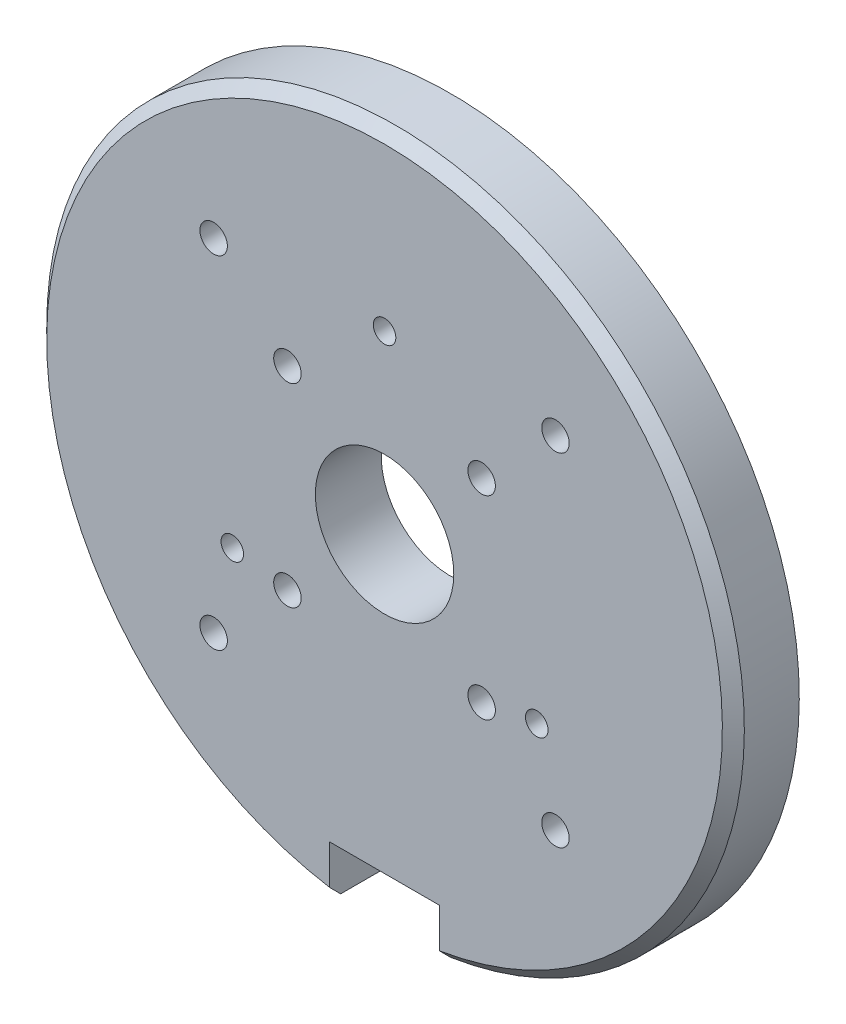
ISO-10303-21;
HEADER;
FILE_DESCRIPTION(('STEP AP214'),'2;1');
FILE_NAME('part.step','',(''),(''),'','','');
FILE_SCHEMA(('AUTOMOTIVE_DESIGN { 1 0 10303 214 1 1 1 1 }'));
ENDSEC;
DATA;
#1=APPLICATION_CONTEXT('core data for automotive mechanical design processes');
#2=APPLICATION_PROTOCOL_DEFINITION('international standard','automotive_design',2000,#1);
#3=PRODUCT_CONTEXT('',#1,'mechanical');
#4=PRODUCT('Part','Part','',(#3));
#5=PRODUCT_RELATED_PRODUCT_CATEGORY('part','',(#4));
#6=PRODUCT_DEFINITION_FORMATION('','',#4);
#7=PRODUCT_DEFINITION_CONTEXT('part definition',#1,'design');
#8=PRODUCT_DEFINITION('design','',#6,#7);
#9=PRODUCT_DEFINITION_SHAPE('','',#8);
#10=(LENGTH_UNIT() NAMED_UNIT(*) SI_UNIT(.MILLI.,.METRE.));
#11=(NAMED_UNIT(*) PLANE_ANGLE_UNIT() SI_UNIT($,.RADIAN.));
#12=(NAMED_UNIT(*) SI_UNIT($,.STERADIAN.) SOLID_ANGLE_UNIT());
#13=UNCERTAINTY_MEASURE_WITH_UNIT(LENGTH_MEASURE(1.E-05),#10,'distance_accuracy_value','');
#14=(GEOMETRIC_REPRESENTATION_CONTEXT(3) GLOBAL_UNCERTAINTY_ASSIGNED_CONTEXT((#13)) GLOBAL_UNIT_ASSIGNED_CONTEXT((#10,
#11,#12)) REPRESENTATION_CONTEXT('',''));
#15=CARTESIAN_POINT('',(0.,0.,0.));
#16=DIRECTION('',(0.,0.,1.));
#17=DIRECTION('',(1.,0.,0.));
#18=AXIS2_PLACEMENT_3D('',#15,#16,#17);
#19=CARTESIAN_POINT('',(0.,0.,6.));
#20=DIRECTION('',(0.,0.,-1.));
#21=DIRECTION('',(-1.,0.,0.));
#22=AXIS2_PLACEMENT_3D('',#19,#20,#21);
#23=CYLINDRICAL_SURFACE('',#22,31.75);
#24=DIRECTION('',(0.,0.,-1.));
#25=VECTOR('',#24,1.);
#26=CARTESIAN_POINT('',(-5.,-31.3538275175456,6.));
#27=LINE('',#26,#25);
#28=CARTESIAN_POINT('',(-5.,-31.3538275175456,0.));
#29=VERTEX_POINT('',#28);
#30=CARTESIAN_POINT('',(-5.,-31.3538275175456,5.00000000000001));
#31=VERTEX_POINT('',#30);
#32=EDGE_CURVE('E144',#29,#31,#27,.F.);
#33=ORIENTED_EDGE('',*,*,#32,.T.);
#34=CARTESIAN_POINT('',(0.,0.,5.00000000000001));
#35=DIRECTION('',(0.,0.,1.));
#36=DIRECTION('',(1.,0.,0.));
#37=AXIS2_PLACEMENT_3D('',#34,#35,#36);
#38=CIRCLE('',#37,31.75);
#39=CARTESIAN_POINT('',(5.,-31.3538275175456,5.));
#40=VERTEX_POINT('',#39);
#41=EDGE_CURVE('E50',#31,#40,#38,.F.);
#42=ORIENTED_EDGE('',*,*,#41,.T.);
#43=DIRECTION('',(0.,0.,-1.));
#44=VECTOR('',#43,1.);
#45=CARTESIAN_POINT('',(5.,-31.3538275175456,6.));
#46=LINE('',#45,#44);
#47=CARTESIAN_POINT('',(5.,-31.3538275175456,0.));
#48=VERTEX_POINT('',#47);
#49=EDGE_CURVE('E116',#40,#48,#46,.T.);
#50=ORIENTED_EDGE('',*,*,#49,.T.);
#51=CARTESIAN_POINT('',(0.,0.,0.));
#52=DIRECTION('',(0.,0.,1.));
#53=DIRECTION('',(1.,0.,0.));
#54=AXIS2_PLACEMENT_3D('',#51,#52,#53);
#55=CIRCLE('',#54,31.75);
#56=EDGE_CURVE('E111',#48,#29,#55,.T.);
#57=ORIENTED_EDGE('',*,*,#56,.T.);
#58=EDGE_LOOP('',(#33,#42,#50,#57));
#59=FACE_BOUND('',#58,.T.);
#60=ADVANCED_FACE('F37',(#59),#23,.T.);
#61=CARTESIAN_POINT('',(0.,0.,6.));
#62=DIRECTION('',(0.,0.,1.));
#63=DIRECTION('',(1.,0.,0.));
#64=AXIS2_PLACEMENT_3D('',#61,#62,#63);
#65=PLANE('',#64);
#66=CARTESIAN_POINT('',(0.,0.,6.));
#67=DIRECTION('',(0.,0.,1.));
#68=DIRECTION('',(1.,0.,0.));
#69=AXIS2_PLACEMENT_3D('',#66,#67,#68);
#70=CIRCLE('',#69,6.3);
#71=CARTESIAN_POINT('',(6.3,0.,6.));
#72=VERTEX_POINT('',#71);
#73=EDGE_CURVE('E225',#72,#72,#70,.T.);
#74=ORIENTED_EDGE('',*,*,#73,.F.);
#75=EDGE_LOOP('',(#74));
#76=FACE_BOUND('',#75,.T.);
#77=CARTESIAN_POINT('',(-15.5563491861041,15.556349186104,6.));
#78=DIRECTION('',(0.,0.,1.));
#79=DIRECTION('',(1.,0.,0.));
#80=AXIS2_PLACEMENT_3D('',#77,#78,#79);
#81=CIRCLE('',#80,1.24999999999999);
#82=CARTESIAN_POINT('',(-14.3063491861041,15.556349186104,6.));
#83=VERTEX_POINT('',#82);
#84=EDGE_CURVE('E221',#83,#83,#81,.T.);
#85=ORIENTED_EDGE('',*,*,#84,.F.);
#86=EDGE_LOOP('',(#85));
#87=FACE_BOUND('',#86,.T.);
#88=CARTESIAN_POINT('',(-15.556349186104,-15.5563491861041,6.));
#89=DIRECTION('',(0.,0.,1.));
#90=DIRECTION('',(1.,0.,0.));
#91=AXIS2_PLACEMENT_3D('',#88,#89,#90);
#92=CIRCLE('',#91,1.24999999999999);
#93=CARTESIAN_POINT('',(-14.306349186104,-15.5563491861041,6.));
#94=VERTEX_POINT('',#93);
#95=EDGE_CURVE('E215',#94,#94,#92,.T.);
#96=ORIENTED_EDGE('',*,*,#95,.F.);
#97=EDGE_LOOP('',(#96));
#98=FACE_BOUND('',#97,.T.);
#99=CARTESIAN_POINT('',(15.556349186104,-15.5563491861041,6.));
#100=DIRECTION('',(0.,0.,1.));
#101=DIRECTION('',(1.,0.,0.));
#102=AXIS2_PLACEMENT_3D('',#99,#100,#101);
#103=CIRCLE('',#102,1.24999999999999);
#104=CARTESIAN_POINT('',(16.806349186104,-15.5563491861041,6.));
#105=VERTEX_POINT('',#104);
#106=EDGE_CURVE('E209',#105,#105,#103,.T.);
#107=ORIENTED_EDGE('',*,*,#106,.F.);
#108=EDGE_LOOP('',(#107));
#109=FACE_BOUND('',#108,.T.);
#110=CARTESIAN_POINT('',(15.5563491861041,15.556349186104,6.));
#111=DIRECTION('',(0.,0.,1.));
#112=DIRECTION('',(1.,0.,0.));
#113=AXIS2_PLACEMENT_3D('',#110,#111,#112);
#114=CIRCLE('',#113,1.24999999999999);
#115=CARTESIAN_POINT('',(16.806349186104,15.556349186104,6.));
#116=VERTEX_POINT('',#115);
#117=EDGE_CURVE('E203',#116,#116,#114,.T.);
#118=ORIENTED_EDGE('',*,*,#117,.F.);
#119=EDGE_LOOP('',(#118));
#120=FACE_BOUND('',#119,.T.);
#121=CARTESIAN_POINT('',(8.83883476483186,8.83883476483183,6.));
#122=DIRECTION('',(0.,0.,1.));
#123=DIRECTION('',(1.,0.,0.));
#124=AXIS2_PLACEMENT_3D('',#121,#122,#123);
#125=CIRCLE('',#124,1.24999999999999);
#126=CARTESIAN_POINT('',(10.0888347648318,8.83883476483183,6.));
#127=VERTEX_POINT('',#126);
#128=EDGE_CURVE('E197',#127,#127,#125,.T.);
#129=ORIENTED_EDGE('',*,*,#128,.F.);
#130=EDGE_LOOP('',(#129));
#131=FACE_BOUND('',#130,.T.);
#132=CARTESIAN_POINT('',(-8.83883476483186,8.83883476483183,6.));
#133=DIRECTION('',(0.,0.,1.));
#134=DIRECTION('',(1.,0.,0.));
#135=AXIS2_PLACEMENT_3D('',#132,#133,#134);
#136=CIRCLE('',#135,1.24999999999999);
#137=CARTESIAN_POINT('',(-7.58883476483188,8.83883476483183,6.));
#138=VERTEX_POINT('',#137);
#139=EDGE_CURVE('E191',#138,#138,#136,.T.);
#140=ORIENTED_EDGE('',*,*,#139,.F.);
#141=EDGE_LOOP('',(#140));
#142=FACE_BOUND('',#141,.T.);
#143=CARTESIAN_POINT('',(-8.83883476483183,-8.83883476483186,6.));
#144=DIRECTION('',(0.,0.,1.));
#145=DIRECTION('',(1.,0.,0.));
#146=AXIS2_PLACEMENT_3D('',#143,#144,#145);
#147=CIRCLE('',#146,1.24999999999999);
#148=CARTESIAN_POINT('',(-7.58883476483184,-8.83883476483186,6.));
#149=VERTEX_POINT('',#148);
#150=EDGE_CURVE('E185',#149,#149,#147,.T.);
#151=ORIENTED_EDGE('',*,*,#150,.F.);
#152=EDGE_LOOP('',(#151));
#153=FACE_BOUND('',#152,.T.);
#154=CARTESIAN_POINT('',(8.83883476483183,-8.83883476483186,6.));
#155=DIRECTION('',(0.,0.,1.));
#156=DIRECTION('',(1.,0.,0.));
#157=AXIS2_PLACEMENT_3D('',#154,#155,#156);
#158=CIRCLE('',#157,1.24999999999999);
#159=CARTESIAN_POINT('',(10.0888347648318,-8.83883476483186,6.));
#160=VERTEX_POINT('',#159);
#161=EDGE_CURVE('E179',#160,#160,#158,.T.);
#162=ORIENTED_EDGE('',*,*,#161,.F.);
#163=EDGE_LOOP('',(#162));
#164=FACE_BOUND('',#163,.T.);
#165=CARTESIAN_POINT('',(0.,16.,6.));
#166=DIRECTION('',(0.,0.,1.));
#167=DIRECTION('',(1.,0.,0.));
#168=AXIS2_PLACEMENT_3D('',#165,#166,#167);
#169=CIRCLE('',#168,1.02499999999999);
#170=CARTESIAN_POINT('',(1.02499999999999,16.,6.));
#171=VERTEX_POINT('',#170);
#172=EDGE_CURVE('E173',#171,#171,#169,.T.);
#173=ORIENTED_EDGE('',*,*,#172,.F.);
#174=EDGE_LOOP('',(#173));
#175=FACE_BOUND('',#174,.T.);
#176=CARTESIAN_POINT('',(13.856406460551,-7.99999999999996,6.));
#177=DIRECTION('',(0.,0.,1.));
#178=DIRECTION('',(1.,0.,0.));
#179=AXIS2_PLACEMENT_3D('',#176,#177,#178);
#180=CIRCLE('',#179,1.02499999999999);
#181=CARTESIAN_POINT('',(14.881406460551,-7.99999999999996,6.));
#182=VERTEX_POINT('',#181);
#183=EDGE_CURVE('E167',#182,#182,#180,.T.);
#184=ORIENTED_EDGE('',*,*,#183,.F.);
#185=EDGE_LOOP('',(#184));
#186=FACE_BOUND('',#185,.T.);
#187=CARTESIAN_POINT('',(-13.856406460551,-7.99999999999997,6.));
#188=DIRECTION('',(0.,0.,1.));
#189=DIRECTION('',(1.,0.,0.));
#190=AXIS2_PLACEMENT_3D('',#187,#188,#189);
#191=CIRCLE('',#190,1.02499999999999);
#192=CARTESIAN_POINT('',(-12.831406460551,-7.99999999999997,6.));
#193=VERTEX_POINT('',#192);
#194=EDGE_CURVE('E156',#193,#193,#191,.T.);
#195=ORIENTED_EDGE('',*,*,#194,.F.);
#196=EDGE_LOOP('',(#195));
#197=FACE_BOUND('',#196,.T.);
#198=DIRECTION('',(0.,1.,0.));
#199=VECTOR('',#198,1.);
#200=CARTESIAN_POINT('',(5.,-26.75,6.));
#201=LINE('',#200,#199);
#202=CARTESIAN_POINT('',(5.,-30.3407728972088,6.));
#203=VERTEX_POINT('',#202);
#204=CARTESIAN_POINT('',(5.,-26.75,6.));
#205=VERTEX_POINT('',#204);
#206=EDGE_CURVE('E94',#203,#205,#201,.T.);
#207=ORIENTED_EDGE('',*,*,#206,.F.);
#208=CARTESIAN_POINT('',(0.,0.,6.));
#209=DIRECTION('',(0.,0.,1.));
#210=DIRECTION('',(1.,0.,0.));
#211=AXIS2_PLACEMENT_3D('',#208,#209,#210);
#212=CIRCLE('',#211,30.75);
#213=CARTESIAN_POINT('',(-5.,-30.3407728972088,6.));
#214=VERTEX_POINT('',#213);
#215=EDGE_CURVE('E112',#203,#214,#212,.T.);
#216=ORIENTED_EDGE('',*,*,#215,.T.);
#217=DIRECTION('',(0.,-1.,0.));
#218=VECTOR('',#217,1.);
#219=CARTESIAN_POINT('',(-5.,-26.75,6.));
#220=LINE('',#219,#218);
#221=CARTESIAN_POINT('',(-5.,-26.75,6.));
#222=VERTEX_POINT('',#221);
#223=EDGE_CURVE('E107',#222,#214,#220,.T.);
#224=ORIENTED_EDGE('',*,*,#223,.F.);
#225=DIRECTION('',(-1.,0.,0.));
#226=VECTOR('',#225,1.);
#227=CARTESIAN_POINT('',(-5.,-26.75,6.));
#228=LINE('',#227,#226);
#229=EDGE_CURVE('E151',#205,#222,#228,.T.);
#230=ORIENTED_EDGE('',*,*,#229,.F.);
#231=EDGE_LOOP('',(#207,#216,#224,#230));
#232=FACE_BOUND('',#231,.T.);
#233=ADVANCED_FACE('F135',(#76,#87,#98,#109,#120,#131,#142,#153,#164,#175,#186,#197,#232),#65,.T.);
#234=CARTESIAN_POINT('',(0.,0.,0.));
#235=DIRECTION('',(0.,0.,1.));
#236=DIRECTION('',(1.,0.,0.));
#237=AXIS2_PLACEMENT_3D('',#234,#235,#236);
#238=PLANE('',#237);
#239=CARTESIAN_POINT('',(0.,0.,0.));
#240=DIRECTION('',(0.,0.,1.));
#241=DIRECTION('',(1.,0.,0.));
#242=AXIS2_PLACEMENT_3D('',#239,#240,#241);
#243=CIRCLE('',#242,6.3);
#244=CARTESIAN_POINT('',(6.3,0.,0.));
#245=VERTEX_POINT('',#244);
#246=EDGE_CURVE('E224',#245,#245,#243,.T.);
#247=ORIENTED_EDGE('',*,*,#246,.T.);
#248=EDGE_LOOP('',(#247));
#249=FACE_BOUND('',#248,.T.);
#250=CARTESIAN_POINT('',(-15.5563491861041,15.556349186104,0.));
#251=DIRECTION('',(0.,0.,1.));
#252=DIRECTION('',(1.,0.,0.));
#253=AXIS2_PLACEMENT_3D('',#250,#251,#252);
#254=CIRCLE('',#253,1.25);
#255=CARTESIAN_POINT('',(-14.3063491861041,15.556349186104,0.));
#256=VERTEX_POINT('',#255);
#257=EDGE_CURVE('E218',#256,#256,#254,.T.);
#258=ORIENTED_EDGE('',*,*,#257,.T.);
#259=EDGE_LOOP('',(#258));
#260=FACE_BOUND('',#259,.T.);
#261=CARTESIAN_POINT('',(-15.556349186104,-15.5563491861041,0.));
#262=DIRECTION('',(0.,0.,1.));
#263=DIRECTION('',(1.,0.,0.));
#264=AXIS2_PLACEMENT_3D('',#261,#262,#263);
#265=CIRCLE('',#264,1.25);
#266=CARTESIAN_POINT('',(-14.306349186104,-15.5563491861041,0.));
#267=VERTEX_POINT('',#266);
#268=EDGE_CURVE('E212',#267,#267,#265,.T.);
#269=ORIENTED_EDGE('',*,*,#268,.T.);
#270=EDGE_LOOP('',(#269));
#271=FACE_BOUND('',#270,.T.);
#272=CARTESIAN_POINT('',(15.556349186104,-15.5563491861041,0.));
#273=DIRECTION('',(0.,0.,1.));
#274=DIRECTION('',(1.,0.,0.));
#275=AXIS2_PLACEMENT_3D('',#272,#273,#274);
#276=CIRCLE('',#275,1.25);
#277=CARTESIAN_POINT('',(16.806349186104,-15.5563491861041,0.));
#278=VERTEX_POINT('',#277);
#279=EDGE_CURVE('E206',#278,#278,#276,.T.);
#280=ORIENTED_EDGE('',*,*,#279,.T.);
#281=EDGE_LOOP('',(#280));
#282=FACE_BOUND('',#281,.T.);
#283=CARTESIAN_POINT('',(15.5563491861041,15.556349186104,0.));
#284=DIRECTION('',(0.,0.,1.));
#285=DIRECTION('',(1.,0.,0.));
#286=AXIS2_PLACEMENT_3D('',#283,#284,#285);
#287=CIRCLE('',#286,1.25);
#288=CARTESIAN_POINT('',(16.8063491861041,15.556349186104,0.));
#289=VERTEX_POINT('',#288);
#290=EDGE_CURVE('E200',#289,#289,#287,.T.);
#291=ORIENTED_EDGE('',*,*,#290,.T.);
#292=EDGE_LOOP('',(#291));
#293=FACE_BOUND('',#292,.T.);
#294=CARTESIAN_POINT('',(8.83883476483186,8.83883476483183,0.));
#295=DIRECTION('',(0.,0.,1.));
#296=DIRECTION('',(1.,0.,0.));
#297=AXIS2_PLACEMENT_3D('',#294,#295,#296);
#298=CIRCLE('',#297,1.25);
#299=CARTESIAN_POINT('',(10.0888347648319,8.83883476483183,0.));
#300=VERTEX_POINT('',#299);
#301=EDGE_CURVE('E194',#300,#300,#298,.T.);
#302=ORIENTED_EDGE('',*,*,#301,.T.);
#303=EDGE_LOOP('',(#302));
#304=FACE_BOUND('',#303,.T.);
#305=CARTESIAN_POINT('',(-8.83883476483186,8.83883476483183,0.));
#306=DIRECTION('',(0.,0.,1.));
#307=DIRECTION('',(1.,0.,0.));
#308=AXIS2_PLACEMENT_3D('',#305,#306,#307);
#309=CIRCLE('',#308,1.25);
#310=CARTESIAN_POINT('',(-7.58883476483187,8.83883476483183,0.));
#311=VERTEX_POINT('',#310);
#312=EDGE_CURVE('E188',#311,#311,#309,.T.);
#313=ORIENTED_EDGE('',*,*,#312,.T.);
#314=EDGE_LOOP('',(#313));
#315=FACE_BOUND('',#314,.T.);
#316=CARTESIAN_POINT('',(-8.83883476483183,-8.83883476483186,0.));
#317=DIRECTION('',(0.,0.,1.));
#318=DIRECTION('',(1.,0.,0.));
#319=AXIS2_PLACEMENT_3D('',#316,#317,#318);
#320=CIRCLE('',#319,1.25);
#321=CARTESIAN_POINT('',(-7.58883476483183,-8.83883476483186,0.));
#322=VERTEX_POINT('',#321);
#323=EDGE_CURVE('E182',#322,#322,#320,.T.);
#324=ORIENTED_EDGE('',*,*,#323,.T.);
#325=EDGE_LOOP('',(#324));
#326=FACE_BOUND('',#325,.T.);
#327=CARTESIAN_POINT('',(8.83883476483183,-8.83883476483186,0.));
#328=DIRECTION('',(0.,0.,1.));
#329=DIRECTION('',(1.,0.,0.));
#330=AXIS2_PLACEMENT_3D('',#327,#328,#329);
#331=CIRCLE('',#330,1.25);
#332=CARTESIAN_POINT('',(10.0888347648318,-8.83883476483186,0.));
#333=VERTEX_POINT('',#332);
#334=EDGE_CURVE('E176',#333,#333,#331,.T.);
#335=ORIENTED_EDGE('',*,*,#334,.T.);
#336=EDGE_LOOP('',(#335));
#337=FACE_BOUND('',#336,.T.);
#338=CARTESIAN_POINT('',(0.,16.,0.));
#339=DIRECTION('',(0.,0.,1.));
#340=DIRECTION('',(1.,0.,0.));
#341=AXIS2_PLACEMENT_3D('',#338,#339,#340);
#342=CIRCLE('',#341,1.025);
#343=CARTESIAN_POINT('',(1.025,16.,0.));
#344=VERTEX_POINT('',#343);
#345=EDGE_CURVE('E170',#344,#344,#342,.T.);
#346=ORIENTED_EDGE('',*,*,#345,.T.);
#347=EDGE_LOOP('',(#346));
#348=FACE_BOUND('',#347,.T.);
#349=CARTESIAN_POINT('',(13.856406460551,-7.99999999999996,0.));
#350=DIRECTION('',(0.,0.,1.));
#351=DIRECTION('',(1.,0.,0.));
#352=AXIS2_PLACEMENT_3D('',#349,#350,#351);
#353=CIRCLE('',#352,1.025);
#354=CARTESIAN_POINT('',(14.881406460551,-7.99999999999996,0.));
#355=VERTEX_POINT('',#354);
#356=EDGE_CURVE('E164',#355,#355,#353,.T.);
#357=ORIENTED_EDGE('',*,*,#356,.T.);
#358=EDGE_LOOP('',(#357));
#359=FACE_BOUND('',#358,.T.);
#360=CARTESIAN_POINT('',(-13.856406460551,-7.99999999999997,0.));
#361=DIRECTION('',(0.,0.,1.));
#362=DIRECTION('',(1.,0.,0.));
#363=AXIS2_PLACEMENT_3D('',#360,#361,#362);
#364=CIRCLE('',#363,1.025);
#365=CARTESIAN_POINT('',(-12.831406460551,-7.99999999999997,0.));
#366=VERTEX_POINT('',#365);
#367=EDGE_CURVE('E152',#366,#366,#364,.T.);
#368=ORIENTED_EDGE('',*,*,#367,.T.);
#369=EDGE_LOOP('',(#368));
#370=FACE_BOUND('',#369,.T.);
#371=ORIENTED_EDGE('',*,*,#56,.F.);
#372=DIRECTION('',(0.,1.,0.));
#373=VECTOR('',#372,1.);
#374=CARTESIAN_POINT('',(4.99999999999999,0.,0.));
#375=LINE('',#374,#373);
#376=CARTESIAN_POINT('',(5.,-26.75,0.));
#377=VERTEX_POINT('',#376);
#378=EDGE_CURVE('E91',#48,#377,#375,.T.);
#379=ORIENTED_EDGE('',*,*,#378,.T.);
#380=DIRECTION('',(-1.,0.,0.));
#381=VECTOR('',#380,1.);
#382=CARTESIAN_POINT('',(-5.,-26.75,0.));
#383=LINE('',#382,#381);
#384=CARTESIAN_POINT('',(-5.,-26.75,0.));
#385=VERTEX_POINT('',#384);
#386=EDGE_CURVE('E103',#377,#385,#383,.T.);
#387=ORIENTED_EDGE('',*,*,#386,.T.);
#388=DIRECTION('',(0.,-1.,0.));
#389=VECTOR('',#388,1.);
#390=CARTESIAN_POINT('',(-5.,-26.75,0.));
#391=LINE('',#390,#389);
#392=EDGE_CURVE('E99',#385,#29,#391,.T.);
#393=ORIENTED_EDGE('',*,*,#392,.T.);
#394=EDGE_LOOP('',(#371,#379,#387,#393));
#395=FACE_BOUND('',#394,.T.);
#396=ADVANCED_FACE('F109',(#249,#260,#271,#282,#293,#304,#315,#326,#337,#348,#359,#370,#395),
#238,.F.);
#397=CARTESIAN_POINT('',(5.,-26.75,0.));
#398=DIRECTION('',(1.,0.,0.));
#399=DIRECTION('',(0.,1.,0.));
#400=AXIS2_PLACEMENT_3D('',#397,#398,#399);
#401=PLANE('',#400);
#402=ORIENTED_EDGE('',*,*,#49,.F.);
#403=CARTESIAN_POINT('',(5.,-31.3538275175456,5.00000000000001));
#404=CARTESIAN_POINT('',(5.,-31.1850201174581,5.16670216063221));
#405=CARTESIAN_POINT('',(5.,-31.0161951990678,5.33338657426692));
#406=CARTESIAN_POINT('',(5.,-30.6785103256222,5.66671990760026));
#407=CARTESIAN_POINT('',(5.,-30.5096503705669,5.83336882729889));
#408=CARTESIAN_POINT('',(5.,-30.3407728972088,6.));
#409=B_SPLINE_CURVE_WITH_KNOTS('',3,(#403,#404,#405,#406,#407,#408),.UNSPECIFIED.,.F.,.F.,(4,2,
4),(0.,0.711737255849346,1.42347451195032),.UNSPECIFIED.);
#410=EDGE_CURVE('E11',#40,#203,#409,.T.);
#411=ORIENTED_EDGE('',*,*,#410,.T.);
#412=ORIENTED_EDGE('',*,*,#206,.T.);
#413=DIRECTION('',(0.,0.,1.));
#414=VECTOR('',#413,1.);
#415=CARTESIAN_POINT('',(5.,-26.75,0.));
#416=LINE('',#415,#414);
#417=EDGE_CURVE('E87',#377,#205,#416,.T.);
#418=ORIENTED_EDGE('',*,*,#417,.F.);
#419=ORIENTED_EDGE('',*,*,#378,.F.);
#420=EDGE_LOOP('',(#402,#411,#412,#418,#419));
#421=FACE_BOUND('',#420,.T.);
#422=ADVANCED_FACE('F89',(#421),#401,.F.);
#423=CARTESIAN_POINT('',(-5.,-26.75,0.));
#424=DIRECTION('',(-1.,0.,0.));
#425=DIRECTION('',(0.,-1.,0.));
#426=AXIS2_PLACEMENT_3D('',#423,#424,#425);
#427=PLANE('',#426);
#428=ORIENTED_EDGE('',*,*,#223,.T.);
#429=CARTESIAN_POINT('',(-5.,-30.3407728972088,6.));
#430=CARTESIAN_POINT('',(-5.,-30.5096503705669,5.83336882729889));
#431=CARTESIAN_POINT('',(-5.,-30.6785103256222,5.66671990760027));
#432=CARTESIAN_POINT('',(-5.,-31.0161951990678,5.33338657426692));
#433=CARTESIAN_POINT('',(-5.,-31.1850201174581,5.16670216063222));
#434=CARTESIAN_POINT('',(-5.,-31.3538275175456,5.00000000000001));
#435=B_SPLINE_CURVE_WITH_KNOTS('',3,(#429,#430,#431,#432,#433,#434),.UNSPECIFIED.,.F.,.F.,(4,2,
4),(0.,0.71173725610097,1.42347451195031),.UNSPECIFIED.);
#436=EDGE_CURVE('E64',#214,#31,#435,.T.);
#437=ORIENTED_EDGE('',*,*,#436,.T.);
#438=ORIENTED_EDGE('',*,*,#32,.F.);
#439=ORIENTED_EDGE('',*,*,#392,.F.);
#440=DIRECTION('',(0.,0.,1.));
#441=VECTOR('',#440,1.);
#442=CARTESIAN_POINT('',(-5.,-26.75,0.));
#443=LINE('',#442,#441);
#444=EDGE_CURVE('E98',#385,#222,#443,.T.);
#445=ORIENTED_EDGE('',*,*,#444,.T.);
#446=EDGE_LOOP('',(#428,#437,#438,#439,#445));
#447=FACE_BOUND('',#446,.T.);
#448=ADVANCED_FACE('F124',(#447),#427,.F.);
#449=CARTESIAN_POINT('',(-5.,-26.75,0.));
#450=DIRECTION('',(0.,1.,0.));
#451=DIRECTION('',(0.,0.,1.));
#452=AXIS2_PLACEMENT_3D('',#449,#450,#451);
#453=PLANE('',#452);
#454=ORIENTED_EDGE('',*,*,#229,.T.);
#455=ORIENTED_EDGE('',*,*,#444,.F.);
#456=ORIENTED_EDGE('',*,*,#386,.F.);
#457=ORIENTED_EDGE('',*,*,#417,.T.);
#458=EDGE_LOOP('',(#454,#455,#456,#457));
#459=FACE_BOUND('',#458,.T.);
#460=ADVANCED_FACE('F104',(#459),#453,.F.);
#461=CARTESIAN_POINT('',(-13.856406460551,-7.99999999999997,6.));
#462=DIRECTION('',(0.,0.,1.));
#463=DIRECTION('',(1.,0.,0.));
#464=AXIS2_PLACEMENT_3D('',#461,#462,#463);
#465=CYLINDRICAL_SURFACE('',#464,1.02499999999999);
#466=ORIENTED_EDGE('',*,*,#367,.F.);
#467=EDGE_LOOP('',(#466));
#468=FACE_BOUND('',#467,.T.);
#469=ORIENTED_EDGE('',*,*,#194,.T.);
#470=EDGE_LOOP('',(#469));
#471=FACE_BOUND('',#470,.T.);
#472=ADVANCED_FACE('F129',(#468,#471),#465,.F.);
#473=CARTESIAN_POINT('',(13.856406460551,-7.99999999999996,6.));
#474=DIRECTION('',(0.,0.,1.));
#475=DIRECTION('',(1.,0.,0.));
#476=AXIS2_PLACEMENT_3D('',#473,#474,#475);
#477=CYLINDRICAL_SURFACE('',#476,1.02499999999999);
#478=ORIENTED_EDGE('',*,*,#356,.F.);
#479=EDGE_LOOP('',(#478));
#480=FACE_BOUND('',#479,.T.);
#481=ORIENTED_EDGE('',*,*,#183,.T.);
#482=EDGE_LOOP('',(#481));
#483=FACE_BOUND('',#482,.T.);
#484=ADVANCED_FACE('F262',(#480,#483),#477,.F.);
#485=CARTESIAN_POINT('',(0.,16.,6.));
#486=DIRECTION('',(0.,0.,1.));
#487=DIRECTION('',(1.,0.,0.));
#488=AXIS2_PLACEMENT_3D('',#485,#486,#487);
#489=CYLINDRICAL_SURFACE('',#488,1.02499999999999);
#490=ORIENTED_EDGE('',*,*,#345,.F.);
#491=EDGE_LOOP('',(#490));
#492=FACE_BOUND('',#491,.T.);
#493=ORIENTED_EDGE('',*,*,#172,.T.);
#494=EDGE_LOOP('',(#493));
#495=FACE_BOUND('',#494,.T.);
#496=ADVANCED_FACE('F267',(#492,#495),#489,.F.);
#497=CARTESIAN_POINT('',(8.83883476483183,-8.83883476483186,6.));
#498=DIRECTION('',(0.,0.,1.));
#499=DIRECTION('',(1.,0.,0.));
#500=AXIS2_PLACEMENT_3D('',#497,#498,#499);
#501=CYLINDRICAL_SURFACE('',#500,1.24999999999999);
#502=ORIENTED_EDGE('',*,*,#334,.F.);
#503=EDGE_LOOP('',(#502));
#504=FACE_BOUND('',#503,.T.);
#505=ORIENTED_EDGE('',*,*,#161,.T.);
#506=EDGE_LOOP('',(#505));
#507=FACE_BOUND('',#506,.T.);
#508=ADVANCED_FACE('F274',(#504,#507),#501,.F.);
#509=CARTESIAN_POINT('',(-8.83883476483183,-8.83883476483186,6.));
#510=DIRECTION('',(0.,0.,1.));
#511=DIRECTION('',(1.,0.,0.));
#512=AXIS2_PLACEMENT_3D('',#509,#510,#511);
#513=CYLINDRICAL_SURFACE('',#512,1.24999999999999);
#514=ORIENTED_EDGE('',*,*,#323,.F.);
#515=EDGE_LOOP('',(#514));
#516=FACE_BOUND('',#515,.T.);
#517=ORIENTED_EDGE('',*,*,#150,.T.);
#518=EDGE_LOOP('',(#517));
#519=FACE_BOUND('',#518,.T.);
#520=ADVANCED_FACE('F282',(#516,#519),#513,.F.);
#521=CARTESIAN_POINT('',(-8.83883476483186,8.83883476483183,6.));
#522=DIRECTION('',(0.,0.,1.));
#523=DIRECTION('',(1.,0.,0.));
#524=AXIS2_PLACEMENT_3D('',#521,#522,#523);
#525=CYLINDRICAL_SURFACE('',#524,1.24999999999999);
#526=ORIENTED_EDGE('',*,*,#312,.F.);
#527=EDGE_LOOP('',(#526));
#528=FACE_BOUND('',#527,.T.);
#529=ORIENTED_EDGE('',*,*,#139,.T.);
#530=EDGE_LOOP('',(#529));
#531=FACE_BOUND('',#530,.T.);
#532=ADVANCED_FACE('F286',(#528,#531),#525,.F.);
#533=CARTESIAN_POINT('',(8.83883476483186,8.83883476483183,6.));
#534=DIRECTION('',(0.,0.,1.));
#535=DIRECTION('',(1.,0.,0.));
#536=AXIS2_PLACEMENT_3D('',#533,#534,#535);
#537=CYLINDRICAL_SURFACE('',#536,1.24999999999999);
#538=ORIENTED_EDGE('',*,*,#301,.F.);
#539=EDGE_LOOP('',(#538));
#540=FACE_BOUND('',#539,.T.);
#541=ORIENTED_EDGE('',*,*,#128,.T.);
#542=EDGE_LOOP('',(#541));
#543=FACE_BOUND('',#542,.T.);
#544=ADVANCED_FACE('F290',(#540,#543),#537,.F.);
#545=CARTESIAN_POINT('',(15.5563491861041,15.556349186104,6.));
#546=DIRECTION('',(0.,0.,1.));
#547=DIRECTION('',(1.,0.,0.));
#548=AXIS2_PLACEMENT_3D('',#545,#546,#547);
#549=CYLINDRICAL_SURFACE('',#548,1.24999999999999);
#550=ORIENTED_EDGE('',*,*,#290,.F.);
#551=EDGE_LOOP('',(#550));
#552=FACE_BOUND('',#551,.T.);
#553=ORIENTED_EDGE('',*,*,#117,.T.);
#554=EDGE_LOOP('',(#553));
#555=FACE_BOUND('',#554,.T.);
#556=ADVANCED_FACE('F294',(#552,#555),#549,.F.);
#557=CARTESIAN_POINT('',(15.556349186104,-15.5563491861041,6.));
#558=DIRECTION('',(0.,0.,1.));
#559=DIRECTION('',(1.,0.,0.));
#560=AXIS2_PLACEMENT_3D('',#557,#558,#559);
#561=CYLINDRICAL_SURFACE('',#560,1.24999999999999);
#562=ORIENTED_EDGE('',*,*,#279,.F.);
#563=EDGE_LOOP('',(#562));
#564=FACE_BOUND('',#563,.T.);
#565=ORIENTED_EDGE('',*,*,#106,.T.);
#566=EDGE_LOOP('',(#565));
#567=FACE_BOUND('',#566,.T.);
#568=ADVANCED_FACE('F298',(#564,#567),#561,.F.);
#569=CARTESIAN_POINT('',(-15.556349186104,-15.5563491861041,6.));
#570=DIRECTION('',(0.,0.,1.));
#571=DIRECTION('',(1.,0.,0.));
#572=AXIS2_PLACEMENT_3D('',#569,#570,#571);
#573=CYLINDRICAL_SURFACE('',#572,1.24999999999999);
#574=ORIENTED_EDGE('',*,*,#268,.F.);
#575=EDGE_LOOP('',(#574));
#576=FACE_BOUND('',#575,.T.);
#577=ORIENTED_EDGE('',*,*,#95,.T.);
#578=EDGE_LOOP('',(#577));
#579=FACE_BOUND('',#578,.T.);
#580=ADVANCED_FACE('F302',(#576,#579),#573,.F.);
#581=CARTESIAN_POINT('',(-15.5563491861041,15.556349186104,6.));
#582=DIRECTION('',(0.,0.,1.));
#583=DIRECTION('',(1.,0.,0.));
#584=AXIS2_PLACEMENT_3D('',#581,#582,#583);
#585=CYLINDRICAL_SURFACE('',#584,1.24999999999999);
#586=ORIENTED_EDGE('',*,*,#257,.F.);
#587=EDGE_LOOP('',(#586));
#588=FACE_BOUND('',#587,.T.);
#589=ORIENTED_EDGE('',*,*,#84,.T.);
#590=EDGE_LOOP('',(#589));
#591=FACE_BOUND('',#590,.T.);
#592=ADVANCED_FACE('F235',(#588,#591),#585,.F.);
#593=CARTESIAN_POINT('',(0.,0.,0.));
#594=DIRECTION('',(0.,0.,1.));
#595=DIRECTION('',(1.,0.,0.));
#596=AXIS2_PLACEMENT_3D('',#593,#594,#595);
#597=CYLINDRICAL_SURFACE('',#596,6.3);
#598=ORIENTED_EDGE('',*,*,#246,.F.);
#599=EDGE_LOOP('',(#598));
#600=FACE_BOUND('',#599,.T.);
#601=ORIENTED_EDGE('',*,*,#73,.T.);
#602=EDGE_LOOP('',(#601));
#603=FACE_BOUND('',#602,.T.);
#604=ADVANCED_FACE('F232',(#600,#603),#597,.F.);
#605=CARTESIAN_POINT('',(0.,0.,6.));
#606=DIRECTION('',(0.,0.,-1.));
#607=DIRECTION('',(-1.,0.,0.));
#608=AXIS2_PLACEMENT_3D('',#605,#606,#607);
#609=CONICAL_SURFACE('',#608,30.75,0.785398163397445);
#610=ORIENTED_EDGE('',*,*,#410,.F.);
#611=ORIENTED_EDGE('',*,*,#41,.F.);
#612=ORIENTED_EDGE('',*,*,#436,.F.);
#613=ORIENTED_EDGE('',*,*,#215,.F.);
#614=EDGE_LOOP('',(#610,#611,#612,#613));
#615=FACE_BOUND('',#614,.T.);
#616=ADVANCED_FACE('F39',(#615),#609,.T.);
#617=CLOSED_SHELL('',(#60,#233,#396,#422,#448,#460,#472,#484,#496,#508,#520,#532,#544,#556,#568,
#580,#592,#604,#616));
#618=MANIFOLD_SOLID_BREP('B2',#617);
#619=ADVANCED_BREP_SHAPE_REPRESENTATION('',(#18,#618),#14);
#620=SHAPE_DEFINITION_REPRESENTATION(#9,#619);
ENDSEC;
END-ISO-10303-21;
